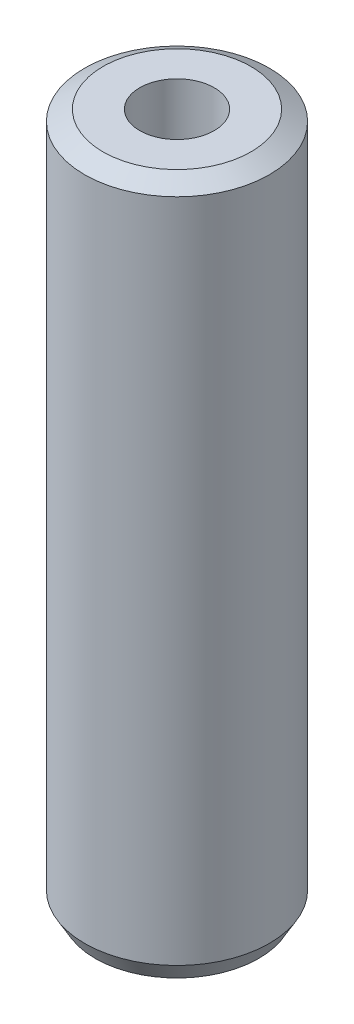
ISO-10303-21;
HEADER;
FILE_DESCRIPTION(('STEP AP214'),'2;1');
FILE_NAME('part.step','',(''),(''),'','','');
FILE_SCHEMA(('AUTOMOTIVE_DESIGN { 1 0 10303 214 1 1 1 1 }'));
ENDSEC;
DATA;
#1=APPLICATION_CONTEXT('core data for automotive mechanical design processes');
#2=APPLICATION_PROTOCOL_DEFINITION('international standard','automotive_design',2000,#1);
#3=PRODUCT_CONTEXT('',#1,'mechanical');
#4=PRODUCT('Part','Part','',(#3));
#5=PRODUCT_RELATED_PRODUCT_CATEGORY('part','',(#4));
#6=PRODUCT_DEFINITION_FORMATION('','',#4);
#7=PRODUCT_DEFINITION_CONTEXT('part definition',#1,'design');
#8=PRODUCT_DEFINITION('design','',#6,#7);
#9=PRODUCT_DEFINITION_SHAPE('','',#8);
#10=(LENGTH_UNIT() NAMED_UNIT(*) SI_UNIT(.MILLI.,.METRE.));
#11=(NAMED_UNIT(*) PLANE_ANGLE_UNIT() SI_UNIT($,.RADIAN.));
#12=(NAMED_UNIT(*) SI_UNIT($,.STERADIAN.) SOLID_ANGLE_UNIT());
#13=UNCERTAINTY_MEASURE_WITH_UNIT(LENGTH_MEASURE(1.E-05),#10,'distance_accuracy_value','');
#14=(GEOMETRIC_REPRESENTATION_CONTEXT(3) GLOBAL_UNCERTAINTY_ASSIGNED_CONTEXT((#13)) GLOBAL_UNIT_ASSIGNED_CONTEXT((#10,
#11,#12)) REPRESENTATION_CONTEXT('',''));
#15=CARTESIAN_POINT('',(0.,0.,0.));
#16=DIRECTION('',(0.,0.,1.));
#17=DIRECTION('',(1.,0.,0.));
#18=AXIS2_PLACEMENT_3D('',#15,#16,#17);
#19=CARTESIAN_POINT('',(0.,263.253868497678,0.));
#20=DIRECTION('',(0.,-1.,0.));
#21=DIRECTION('',(0.,0.,-1.));
#22=AXIS2_PLACEMENT_3D('',#19,#20,#21);
#23=CYLINDRICAL_SURFACE('',#22,35.);
#24=CARTESIAN_POINT('',(0.,259.237690623415,0.));
#25=DIRECTION('',(0.,1.,0.));
#26=DIRECTION('',(0.,0.,1.));
#27=AXIS2_PLACEMENT_3D('',#24,#25,#26);
#28=CIRCLE('',#27,35.);
#29=CARTESIAN_POINT('',(0.,259.237690623415,35.));
#30=VERTEX_POINT('',#29);
#31=EDGE_CURVE('E50',#30,#30,#28,.F.);
#32=ORIENTED_EDGE('',*,*,#31,.T.);
#33=EDGE_LOOP('',(#32));
#34=FACE_BOUND('',#33,.T.);
#35=CARTESIAN_POINT('',(0.,6.95622413045799,0.));
#36=DIRECTION('',(0.,1.,0.));
#37=DIRECTION('',(0.,0.,1.));
#38=AXIS2_PLACEMENT_3D('',#35,#36,#37);
#39=CIRCLE('',#38,35.);
#40=CARTESIAN_POINT('',(0.,6.95622413045799,35.));
#41=VERTEX_POINT('',#40);
#42=EDGE_CURVE('E51',#41,#41,#39,.T.);
#43=ORIENTED_EDGE('',*,*,#42,.T.);
#44=EDGE_LOOP('',(#43));
#45=FACE_BOUND('',#44,.T.);
#46=ADVANCED_FACE('F39',(#34,#45),#23,.T.);
#47=CARTESIAN_POINT('',(0.,263.253868497678,0.));
#48=DIRECTION('',(0.,1.,0.));
#49=DIRECTION('',(0.,0.,1.));
#50=AXIS2_PLACEMENT_3D('',#47,#48,#49);
#51=PLANE('',#50);
#52=CARTESIAN_POINT('',(0.,263.253868497678,0.));
#53=DIRECTION('',(0.,1.,0.));
#54=DIRECTION('',(0.,0.,1.));
#55=AXIS2_PLACEMENT_3D('',#52,#53,#54);
#56=CIRCLE('',#55,28.0437758695419);
#57=CARTESIAN_POINT('',(0.,263.253868497678,28.0437758695419));
#58=VERTEX_POINT('',#57);
#59=EDGE_CURVE('E54',#58,#58,#56,.T.);
#60=ORIENTED_EDGE('',*,*,#59,.T.);
#61=EDGE_LOOP('',(#60));
#62=FACE_BOUND('',#61,.T.);
#63=CARTESIAN_POINT('',(0.,263.253868497678,0.));
#64=DIRECTION('',(0.,1.,0.));
#65=DIRECTION('',(0.,0.,1.));
#66=AXIS2_PLACEMENT_3D('',#63,#64,#65);
#67=CIRCLE('',#66,14.1128052062077);
#68=CARTESIAN_POINT('',(0.,263.253868497678,14.1128052062077));
#69=VERTEX_POINT('',#68);
#70=EDGE_CURVE('E58',#69,#69,#67,.T.);
#71=ORIENTED_EDGE('',*,*,#70,.F.);
#72=EDGE_LOOP('',(#71));
#73=FACE_BOUND('',#72,.T.);
#74=ADVANCED_FACE('F69',(#62,#73),#51,.T.);
#75=CARTESIAN_POINT('',(0.,0.,0.));
#76=DIRECTION('',(0.,1.,0.));
#77=DIRECTION('',(0.,0.,1.));
#78=AXIS2_PLACEMENT_3D('',#75,#76,#77);
#79=PLANE('',#78);
#80=CARTESIAN_POINT('',(0.,0.,0.));
#81=DIRECTION('',(0.,1.,0.));
#82=DIRECTION('',(0.,0.,1.));
#83=AXIS2_PLACEMENT_3D('',#80,#81,#82);
#84=CIRCLE('',#83,30.9838221257367);
#85=CARTESIAN_POINT('',(0.,0.,30.9838221257367));
#86=VERTEX_POINT('',#85);
#87=EDGE_CURVE('E10',#86,#86,#84,.F.);
#88=ORIENTED_EDGE('',*,*,#87,.T.);
#89=EDGE_LOOP('',(#88));
#90=FACE_BOUND('',#89,.T.);
#91=CARTESIAN_POINT('',(0.,0.,0.));
#92=DIRECTION('',(0.,1.,0.));
#93=DIRECTION('',(0.,0.,1.));
#94=AXIS2_PLACEMENT_3D('',#91,#92,#93);
#95=CIRCLE('',#94,14.1128052062077);
#96=CARTESIAN_POINT('',(0.,0.,14.1128052062077));
#97=VERTEX_POINT('',#96);
#98=EDGE_CURVE('E63',#97,#97,#95,.T.);
#99=ORIENTED_EDGE('',*,*,#98,.T.);
#100=EDGE_LOOP('',(#99));
#101=FACE_BOUND('',#100,.T.);
#102=ADVANCED_FACE('F75',(#90,#101),#79,.F.);
#103=CARTESIAN_POINT('',(0.,263.253868497678,0.));
#104=DIRECTION('',(0.,-1.,0.));
#105=DIRECTION('',(0.,0.,-1.));
#106=AXIS2_PLACEMENT_3D('',#103,#104,#105);
#107=CYLINDRICAL_SURFACE('',#106,14.1128052062077);
#108=ORIENTED_EDGE('',*,*,#70,.T.);
#109=EDGE_LOOP('',(#108));
#110=FACE_BOUND('',#109,.T.);
#111=ORIENTED_EDGE('',*,*,#98,.F.);
#112=EDGE_LOOP('',(#111));
#113=FACE_BOUND('',#112,.T.);
#114=ADVANCED_FACE('F70',(#110,#113),#107,.F.);
#115=CARTESIAN_POINT('',(0.,263.253868497678,0.));
#116=DIRECTION('',(0.,-1.,0.));
#117=DIRECTION('',(0.,0.,-1.));
#118=AXIS2_PLACEMENT_3D('',#115,#116,#117);
#119=CONICAL_SURFACE('',#118,28.0437758695419,1.04719755119659);
#120=ORIENTED_EDGE('',*,*,#31,.F.);
#121=EDGE_LOOP('',(#120));
#122=FACE_BOUND('',#121,.T.);
#123=ORIENTED_EDGE('',*,*,#59,.F.);
#124=EDGE_LOOP('',(#123));
#125=FACE_BOUND('',#124,.T.);
#126=ADVANCED_FACE('F81',(#122,#125),#119,.T.);
#127=CARTESIAN_POINT('',(0.,6.95622413045799,0.));
#128=DIRECTION('',(0.,1.,0.));
#129=DIRECTION('',(0.,0.,1.));
#130=AXIS2_PLACEMENT_3D('',#127,#128,#129);
#131=CONICAL_SURFACE('',#130,35.,0.5235987755983);
#132=ORIENTED_EDGE('',*,*,#87,.F.);
#133=EDGE_LOOP('',(#132));
#134=FACE_BOUND('',#133,.T.);
#135=ORIENTED_EDGE('',*,*,#42,.F.);
#136=EDGE_LOOP('',(#135));
#137=FACE_BOUND('',#136,.T.);
#138=ADVANCED_FACE('F45',(#134,#137),#131,.T.);
#139=CLOSED_SHELL('',(#46,#74,#102,#114,#126,#138));
#140=MANIFOLD_SOLID_BREP('B2',#139);
#141=ADVANCED_BREP_SHAPE_REPRESENTATION('',(#18,#140),#14);
#142=SHAPE_DEFINITION_REPRESENTATION(#9,#141);
ENDSEC;
END-ISO-10303-21;
